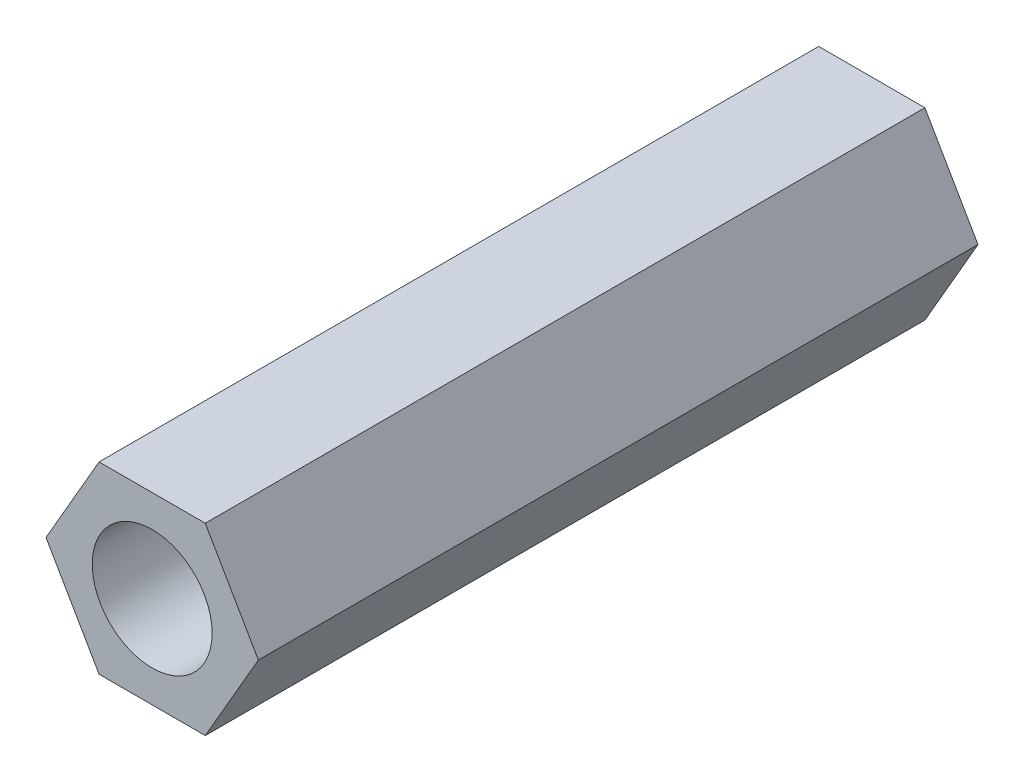
ISO-10303-21;
HEADER;
FILE_DESCRIPTION(('STEP AP214'),'2;1');
FILE_NAME('part.step','',(''),(''),'','','');
FILE_SCHEMA(('AUTOMOTIVE_DESIGN { 1 0 10303 214 1 1 1 1 }'));
ENDSEC;
DATA;
#1=APPLICATION_CONTEXT('core data for automotive mechanical design processes');
#2=APPLICATION_PROTOCOL_DEFINITION('international standard','automotive_design',2000,#1);
#3=PRODUCT_CONTEXT('',#1,'mechanical');
#4=PRODUCT('Part','Part','',(#3));
#5=PRODUCT_RELATED_PRODUCT_CATEGORY('part','',(#4));
#6=PRODUCT_DEFINITION_FORMATION('','',#4);
#7=PRODUCT_DEFINITION_CONTEXT('part definition',#1,'design');
#8=PRODUCT_DEFINITION('design','',#6,#7);
#9=PRODUCT_DEFINITION_SHAPE('','',#8);
#10=(LENGTH_UNIT() NAMED_UNIT(*) SI_UNIT(.MILLI.,.METRE.));
#11=(NAMED_UNIT(*) PLANE_ANGLE_UNIT() SI_UNIT($,.RADIAN.));
#12=(NAMED_UNIT(*) SI_UNIT($,.STERADIAN.) SOLID_ANGLE_UNIT());
#13=UNCERTAINTY_MEASURE_WITH_UNIT(LENGTH_MEASURE(1.E-05),#10,'distance_accuracy_value','');
#14=(GEOMETRIC_REPRESENTATION_CONTEXT(3) GLOBAL_UNCERTAINTY_ASSIGNED_CONTEXT((#13)) GLOBAL_UNIT_ASSIGNED_CONTEXT((#10,
#11,#12)) REPRESENTATION_CONTEXT('',''));
#15=CARTESIAN_POINT('',(0.,0.,0.));
#16=DIRECTION('',(0.,0.,1.));
#17=DIRECTION('',(1.,0.,0.));
#18=AXIS2_PLACEMENT_3D('',#15,#16,#17);
#19=CARTESIAN_POINT('',(0.,0.,18.));
#20=DIRECTION('',(0.,0.,1.));
#21=DIRECTION('',(1.,0.,0.));
#22=AXIS2_PLACEMENT_3D('',#19,#20,#21);
#23=PLANE('',#22);
#24=DIRECTION('',(0.5,0.866025403784439,0.));
#25=VECTOR('',#24,1.);
#26=CARTESIAN_POINT('',(1.32790561913614,-2.3,18.));
#27=LINE('',#26,#25);
#28=CARTESIAN_POINT('',(1.32790561913614,-2.3,18.));
#29=VERTEX_POINT('',#28);
#30=CARTESIAN_POINT('',(2.65581123827228,0.,18.));
#31=VERTEX_POINT('',#30);
#32=EDGE_CURVE('E130',#29,#31,#27,.T.);
#33=ORIENTED_EDGE('',*,*,#32,.T.);
#34=DIRECTION('',(-0.5,0.866025403784439,0.));
#35=VECTOR('',#34,1.);
#36=CARTESIAN_POINT('',(2.65581123827228,0.,18.));
#37=LINE('',#36,#35);
#38=CARTESIAN_POINT('',(1.32790561913614,2.3,18.));
#39=VERTEX_POINT('',#38);
#40=EDGE_CURVE('E88',#31,#39,#37,.T.);
#41=ORIENTED_EDGE('',*,*,#40,.T.);
#42=DIRECTION('',(-1.,0.,0.));
#43=VECTOR('',#42,1.);
#44=CARTESIAN_POINT('',(1.32790561913614,2.3,18.));
#45=LINE('',#44,#43);
#46=CARTESIAN_POINT('',(-1.32790561913614,2.3,18.));
#47=VERTEX_POINT('',#46);
#48=EDGE_CURVE('E101',#39,#47,#45,.T.);
#49=ORIENTED_EDGE('',*,*,#48,.T.);
#50=DIRECTION('',(-0.5,-0.866025403784439,0.));
#51=VECTOR('',#50,1.);
#52=CARTESIAN_POINT('',(-1.32790561913614,2.3,18.));
#53=LINE('',#52,#51);
#54=CARTESIAN_POINT('',(-2.65581123827228,0.,18.));
#55=VERTEX_POINT('',#54);
#56=EDGE_CURVE('E95',#47,#55,#53,.T.);
#57=ORIENTED_EDGE('',*,*,#56,.T.);
#58=DIRECTION('',(0.5,-0.866025403784439,0.));
#59=VECTOR('',#58,1.);
#60=CARTESIAN_POINT('',(-2.65581123827228,0.,18.));
#61=LINE('',#60,#59);
#62=CARTESIAN_POINT('',(-1.32790561913614,-2.3,18.));
#63=VERTEX_POINT('',#62);
#64=EDGE_CURVE('E99',#55,#63,#61,.T.);
#65=ORIENTED_EDGE('',*,*,#64,.T.);
#66=DIRECTION('',(1.,0.,0.));
#67=VECTOR('',#66,1.);
#68=CARTESIAN_POINT('',(-1.32790561913614,-2.3,18.));
#69=LINE('',#68,#67);
#70=EDGE_CURVE('E51',#63,#29,#69,.T.);
#71=ORIENTED_EDGE('',*,*,#70,.T.);
#72=EDGE_LOOP('',(#33,#41,#49,#57,#65,#71));
#73=FACE_BOUND('',#72,.T.);
#74=CARTESIAN_POINT('',(0.,0.,18.));
#75=DIRECTION('',(0.,0.,1.));
#76=DIRECTION('',(1.,0.,0.));
#77=AXIS2_PLACEMENT_3D('',#74,#75,#76);
#78=CIRCLE('',#77,1.5);
#79=CARTESIAN_POINT('',(1.5,0.,18.));
#80=VERTEX_POINT('',#79);
#81=EDGE_CURVE('E123',#80,#80,#78,.T.);
#82=ORIENTED_EDGE('',*,*,#81,.F.);
#83=EDGE_LOOP('',(#82));
#84=FACE_BOUND('',#83,.T.);
#85=ADVANCED_FACE('F34',(#73,#84),#23,.T.);
#86=CARTESIAN_POINT('',(0.,0.,0.));
#87=DIRECTION('',(0.,0.,1.));
#88=DIRECTION('',(1.,0.,0.));
#89=AXIS2_PLACEMENT_3D('',#86,#87,#88);
#90=PLANE('',#89);
#91=DIRECTION('',(0.5,0.866025403784439,0.));
#92=VECTOR('',#91,1.);
#93=CARTESIAN_POINT('',(1.32790561913614,-2.3,0.));
#94=LINE('',#93,#92);
#95=CARTESIAN_POINT('',(1.32790561913614,-2.3,0.));
#96=VERTEX_POINT('',#95);
#97=CARTESIAN_POINT('',(2.65581123827228,0.,0.));
#98=VERTEX_POINT('',#97);
#99=EDGE_CURVE('E119',#96,#98,#94,.T.);
#100=ORIENTED_EDGE('',*,*,#99,.F.);
#101=DIRECTION('',(1.,0.,0.));
#102=VECTOR('',#101,1.);
#103=CARTESIAN_POINT('',(-1.32790561913614,-2.3,0.));
#104=LINE('',#103,#102);
#105=CARTESIAN_POINT('',(-1.32790561913614,-2.3,0.));
#106=VERTEX_POINT('',#105);
#107=EDGE_CURVE('E80',#106,#96,#104,.T.);
#108=ORIENTED_EDGE('',*,*,#107,.F.);
#109=DIRECTION('',(0.5,-0.866025403784439,0.));
#110=VECTOR('',#109,1.);
#111=CARTESIAN_POINT('',(-2.65581123827228,0.,0.));
#112=LINE('',#111,#110);
#113=CARTESIAN_POINT('',(-2.65581123827228,0.,0.));
#114=VERTEX_POINT('',#113);
#115=EDGE_CURVE('E74',#114,#106,#112,.T.);
#116=ORIENTED_EDGE('',*,*,#115,.F.);
#117=DIRECTION('',(-0.5,-0.866025403784439,0.));
#118=VECTOR('',#117,1.);
#119=CARTESIAN_POINT('',(-1.32790561913614,2.3,0.));
#120=LINE('',#119,#118);
#121=CARTESIAN_POINT('',(-1.32790561913614,2.3,0.));
#122=VERTEX_POINT('',#121);
#123=EDGE_CURVE('E109',#122,#114,#120,.T.);
#124=ORIENTED_EDGE('',*,*,#123,.F.);
#125=DIRECTION('',(-1.,0.,0.));
#126=VECTOR('',#125,1.);
#127=CARTESIAN_POINT('',(1.32790561913614,2.3,0.));
#128=LINE('',#127,#126);
#129=CARTESIAN_POINT('',(1.32790561913614,2.3,0.));
#130=VERTEX_POINT('',#129);
#131=EDGE_CURVE('E125',#130,#122,#128,.T.);
#132=ORIENTED_EDGE('',*,*,#131,.F.);
#133=DIRECTION('',(-0.5,0.866025403784439,0.));
#134=VECTOR('',#133,1.);
#135=CARTESIAN_POINT('',(2.65581123827228,0.,0.));
#136=LINE('',#135,#134);
#137=EDGE_CURVE('E122',#98,#130,#136,.T.);
#138=ORIENTED_EDGE('',*,*,#137,.F.);
#139=EDGE_LOOP('',(#100,#108,#116,#124,#132,#138));
#140=FACE_BOUND('',#139,.T.);
#141=CARTESIAN_POINT('',(0.,0.,0.));
#142=DIRECTION('',(0.,0.,1.));
#143=DIRECTION('',(1.,0.,0.));
#144=AXIS2_PLACEMENT_3D('',#141,#142,#143);
#145=CIRCLE('',#144,1.5);
#146=CARTESIAN_POINT('',(1.5,0.,0.));
#147=VERTEX_POINT('',#146);
#148=EDGE_CURVE('E223',#147,#147,#145,.T.);
#149=ORIENTED_EDGE('',*,*,#148,.T.);
#150=EDGE_LOOP('',(#149));
#151=FACE_BOUND('',#150,.T.);
#152=ADVANCED_FACE('F139',(#140,#151),#90,.F.);
#153=CARTESIAN_POINT('',(1.32790561913614,-2.3,18.));
#154=DIRECTION('',(-0.866025403784439,0.5,0.));
#155=DIRECTION('',(-0.5,-0.866025403784439,0.));
#156=AXIS2_PLACEMENT_3D('',#153,#154,#155);
#157=PLANE('',#156);
#158=ORIENTED_EDGE('',*,*,#99,.T.);
#159=DIRECTION('',(0.,0.,-1.));
#160=VECTOR('',#159,1.);
#161=CARTESIAN_POINT('',(2.65581123827228,0.,18.));
#162=LINE('',#161,#160);
#163=EDGE_CURVE('E11',#31,#98,#162,.T.);
#164=ORIENTED_EDGE('',*,*,#163,.F.);
#165=ORIENTED_EDGE('',*,*,#32,.F.);
#166=DIRECTION('',(0.,0.,-1.));
#167=VECTOR('',#166,1.);
#168=CARTESIAN_POINT('',(1.32790561913614,-2.3,18.));
#169=LINE('',#168,#167);
#170=EDGE_CURVE('E115',#29,#96,#169,.T.);
#171=ORIENTED_EDGE('',*,*,#170,.T.);
#172=EDGE_LOOP('',(#158,#164,#165,#171));
#173=FACE_BOUND('',#172,.T.);
#174=ADVANCED_FACE('F36',(#173),#157,.F.);
#175=CARTESIAN_POINT('',(2.65581123827228,0.,18.));
#176=DIRECTION('',(-0.866025403784438,-0.5,0.));
#177=DIRECTION('',(0.5,-0.866025403784439,0.));
#178=AXIS2_PLACEMENT_3D('',#175,#176,#177);
#179=PLANE('',#178);
#180=ORIENTED_EDGE('',*,*,#137,.T.);
#181=DIRECTION('',(0.,0.,-1.));
#182=VECTOR('',#181,1.);
#183=CARTESIAN_POINT('',(1.32790561913614,2.3,18.));
#184=LINE('',#183,#182);
#185=EDGE_CURVE('E43',#39,#130,#184,.T.);
#186=ORIENTED_EDGE('',*,*,#185,.F.);
#187=ORIENTED_EDGE('',*,*,#40,.F.);
#188=ORIENTED_EDGE('',*,*,#163,.T.);
#189=EDGE_LOOP('',(#180,#186,#187,#188));
#190=FACE_BOUND('',#189,.T.);
#191=ADVANCED_FACE('F164',(#190),#179,.F.);
#192=CARTESIAN_POINT('',(1.32790561913614,2.3,18.));
#193=DIRECTION('',(0.,-1.,0.));
#194=DIRECTION('',(0.,0.,-1.));
#195=AXIS2_PLACEMENT_3D('',#192,#193,#194);
#196=PLANE('',#195);
#197=ORIENTED_EDGE('',*,*,#131,.T.);
#198=DIRECTION('',(0.,0.,-1.));
#199=VECTOR('',#198,1.);
#200=CARTESIAN_POINT('',(-1.32790561913614,2.3,18.));
#201=LINE('',#200,#199);
#202=EDGE_CURVE('E110',#47,#122,#201,.T.);
#203=ORIENTED_EDGE('',*,*,#202,.F.);
#204=ORIENTED_EDGE('',*,*,#48,.F.);
#205=ORIENTED_EDGE('',*,*,#185,.T.);
#206=EDGE_LOOP('',(#197,#203,#204,#205));
#207=FACE_BOUND('',#206,.T.);
#208=ADVANCED_FACE('F136',(#207),#196,.F.);
#209=CARTESIAN_POINT('',(-1.32790561913614,2.3,18.));
#210=DIRECTION('',(0.866025403784439,-0.5,0.));
#211=DIRECTION('',(0.5,0.866025403784439,0.));
#212=AXIS2_PLACEMENT_3D('',#209,#210,#211);
#213=PLANE('',#212);
#214=ORIENTED_EDGE('',*,*,#123,.T.);
#215=DIRECTION('',(0.,0.,-1.));
#216=VECTOR('',#215,1.);
#217=CARTESIAN_POINT('',(-2.65581123827228,0.,18.));
#218=LINE('',#217,#216);
#219=EDGE_CURVE('E106',#55,#114,#218,.T.);
#220=ORIENTED_EDGE('',*,*,#219,.F.);
#221=ORIENTED_EDGE('',*,*,#56,.F.);
#222=ORIENTED_EDGE('',*,*,#202,.T.);
#223=EDGE_LOOP('',(#214,#220,#221,#222));
#224=FACE_BOUND('',#223,.T.);
#225=ADVANCED_FACE('F107',(#224),#213,.F.);
#226=CARTESIAN_POINT('',(-2.65581123827228,0.,18.));
#227=DIRECTION('',(0.866025403784438,0.5,0.));
#228=DIRECTION('',(-0.5,0.866025403784439,0.));
#229=AXIS2_PLACEMENT_3D('',#226,#227,#228);
#230=PLANE('',#229);
#231=ORIENTED_EDGE('',*,*,#115,.T.);
#232=DIRECTION('',(0.,0.,-1.));
#233=VECTOR('',#232,1.);
#234=CARTESIAN_POINT('',(-1.32790561913614,-2.3,18.));
#235=LINE('',#234,#233);
#236=EDGE_CURVE('E111',#63,#106,#235,.T.);
#237=ORIENTED_EDGE('',*,*,#236,.F.);
#238=ORIENTED_EDGE('',*,*,#64,.F.);
#239=ORIENTED_EDGE('',*,*,#219,.T.);
#240=EDGE_LOOP('',(#231,#237,#238,#239));
#241=FACE_BOUND('',#240,.T.);
#242=ADVANCED_FACE('F113',(#241),#230,.F.);
#243=CARTESIAN_POINT('',(-1.32790561913614,-2.3,18.));
#244=DIRECTION('',(0.,1.,0.));
#245=DIRECTION('',(-1.,0.,0.));
#246=AXIS2_PLACEMENT_3D('',#243,#244,#245);
#247=PLANE('',#246);
#248=ORIENTED_EDGE('',*,*,#107,.T.);
#249=ORIENTED_EDGE('',*,*,#170,.F.);
#250=ORIENTED_EDGE('',*,*,#70,.F.);
#251=ORIENTED_EDGE('',*,*,#236,.T.);
#252=EDGE_LOOP('',(#248,#249,#250,#251));
#253=FACE_BOUND('',#252,.T.);
#254=ADVANCED_FACE('F144',(#253),#247,.F.);
#255=CARTESIAN_POINT('',(0.,0.,18.));
#256=DIRECTION('',(0.,0.,-1.));
#257=DIRECTION('',(-1.,0.,0.));
#258=AXIS2_PLACEMENT_3D('',#255,#256,#257);
#259=CYLINDRICAL_SURFACE('',#258,1.5);
#260=ORIENTED_EDGE('',*,*,#81,.T.);
#261=EDGE_LOOP('',(#260));
#262=FACE_BOUND('',#261,.T.);
#263=ORIENTED_EDGE('',*,*,#148,.F.);
#264=EDGE_LOOP('',(#263));
#265=FACE_BOUND('',#264,.T.);
#266=ADVANCED_FACE('F146',(#262,#265),#259,.F.);
#267=CLOSED_SHELL('',(#85,#152,#174,#191,#208,#225,#242,#254,#266));
#268=MANIFOLD_SOLID_BREP('B2',#267);
#269=ADVANCED_BREP_SHAPE_REPRESENTATION('',(#18,#268),#14);
#270=SHAPE_DEFINITION_REPRESENTATION(#9,#269);
ENDSEC;
END-ISO-10303-21;
